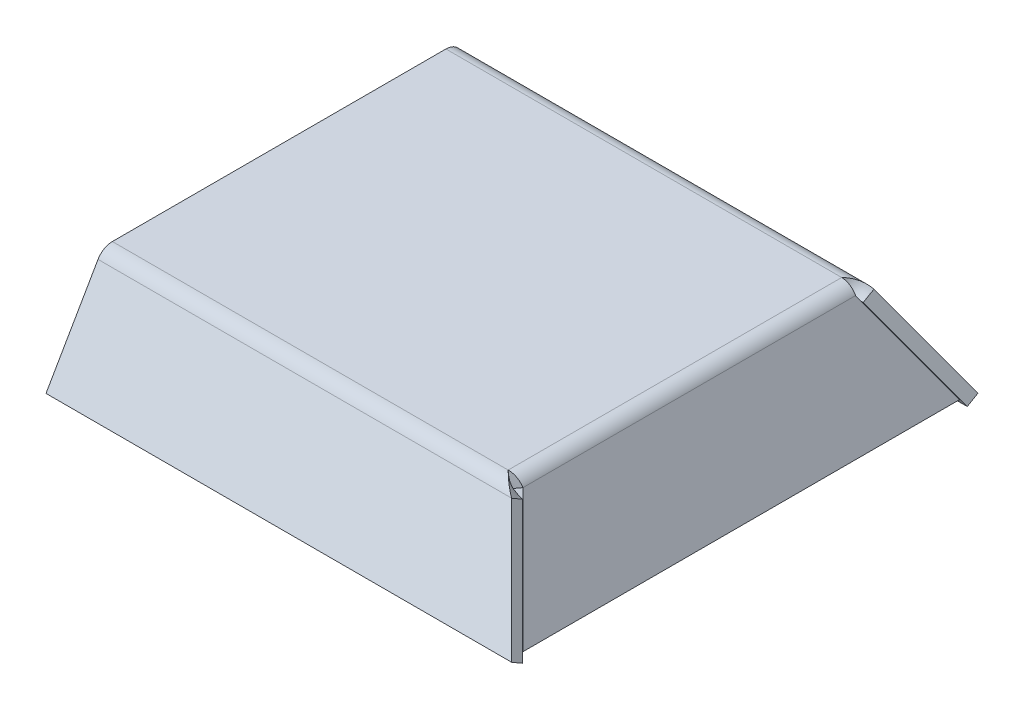
ISO-10303-21;
HEADER;
FILE_DESCRIPTION(('STEP AP214'),'2;1');
FILE_NAME('part.step','',(''),(''),'','','');
FILE_SCHEMA(('AUTOMOTIVE_DESIGN { 1 0 10303 214 1 1 1 1 }'));
ENDSEC;
DATA;
#1=APPLICATION_CONTEXT('core data for automotive mechanical design processes');
#2=APPLICATION_PROTOCOL_DEFINITION('international standard','automotive_design',2000,#1);
#3=PRODUCT_CONTEXT('',#1,'mechanical');
#4=PRODUCT('Part','Part','',(#3));
#5=PRODUCT_RELATED_PRODUCT_CATEGORY('part','',(#4));
#6=PRODUCT_DEFINITION_FORMATION('','',#4);
#7=PRODUCT_DEFINITION_CONTEXT('part definition',#1,'design');
#8=PRODUCT_DEFINITION('design','',#6,#7);
#9=PRODUCT_DEFINITION_SHAPE('','',#8);
#10=(LENGTH_UNIT() NAMED_UNIT(*) SI_UNIT(.MILLI.,.METRE.));
#11=(NAMED_UNIT(*) PLANE_ANGLE_UNIT() SI_UNIT($,.RADIAN.));
#12=(NAMED_UNIT(*) SI_UNIT($,.STERADIAN.) SOLID_ANGLE_UNIT());
#13=UNCERTAINTY_MEASURE_WITH_UNIT(LENGTH_MEASURE(1.E-05),#10,'distance_accuracy_value','');
#14=(GEOMETRIC_REPRESENTATION_CONTEXT(3) GLOBAL_UNCERTAINTY_ASSIGNED_CONTEXT((#13)) GLOBAL_UNIT_ASSIGNED_CONTEXT((#10,
#11,#12)) REPRESENTATION_CONTEXT('',''));
#15=CARTESIAN_POINT('',(0.,0.,0.));
#16=DIRECTION('',(0.,0.,1.));
#17=DIRECTION('',(1.,0.,0.));
#18=AXIS2_PLACEMENT_3D('',#15,#16,#17);
#19=CARTESIAN_POINT('',(0.,-3.00000000000002,0.));
#20=DIRECTION('',(0.,-1.,0.));
#21=DIRECTION('',(0.,0.,-1.));
#22=AXIS2_PLACEMENT_3D('',#19,#20,#21);
#23=PLANE('',#22);
#24=DIRECTION('',(0.,0.,1.));
#25=VECTOR('',#24,1.);
#26=CARTESIAN_POINT('',(0.,-3.00000000000002,0.));
#27=LINE('',#26,#25);
#28=CARTESIAN_POINT('',(0.,-3.00000000000002,-81.1259851993435));
#29=VERTEX_POINT('',#28);
#30=CARTESIAN_POINT('',(0.,-3.00000000000002,-0.577350269189626));
#31=VERTEX_POINT('',#30);
#32=EDGE_CURVE('E488',#29,#31,#27,.T.);
#33=ORIENTED_EDGE('',*,*,#32,.F.);
#34=DIRECTION('',(-1.,0.,0.));
#35=VECTOR('',#34,1.);
#36=CARTESIAN_POINT('',(95.743257010029,-3.00000000000003,-81.1259851993435));
#37=LINE('',#36,#35);
#38=CARTESIAN_POINT('',(95.584338387431,-3.00000000000003,-81.1259851993448));
#39=VERTEX_POINT('',#38);
#40=EDGE_CURVE('E497',#39,#29,#37,.T.);
#41=ORIENTED_EDGE('',*,*,#40,.F.);
#42=DIRECTION('',(0.,0.,-1.));
#43=VECTOR('',#42,1.);
#44=CARTESIAN_POINT('',(95.5843383874312,-3.00000000000002,-0.418431646591708));
#45=LINE('',#44,#43);
#46=CARTESIAN_POINT('',(95.5843383874312,-3.00000000000002,-0.577350269189633));
#47=VERTEX_POINT('',#46);
#48=EDGE_CURVE('E685',#47,#39,#45,.T.);
#49=ORIENTED_EDGE('',*,*,#48,.F.);
#50=DIRECTION('',(1.,0.,0.));
#51=VECTOR('',#50,1.);
#52=CARTESIAN_POINT('',(0.,-3.00000000000002,-0.577350269189626));
#53=LINE('',#52,#51);
#54=EDGE_CURVE('E490',#31,#47,#53,.T.);
#55=ORIENTED_EDGE('',*,*,#54,.F.);
#56=EDGE_LOOP('',(#33,#41,#49,#55));
#57=FACE_BOUND('',#56,.T.);
#58=ADVANCED_FACE('F81',(#57),#23,.T.);
#59=CARTESIAN_POINT('',(0.,0.,0.));
#60=DIRECTION('',(0.,-1.,0.));
#61=DIRECTION('',(0.,0.,-1.));
#62=AXIS2_PLACEMENT_3D('',#59,#60,#61);
#63=PLANE('',#62);
#64=DIRECTION('',(-1.,0.,0.));
#65=VECTOR('',#64,1.);
#66=CARTESIAN_POINT('',(95.743257010029,0.,-81.1259851993435));
#67=LINE('',#66,#65);
#68=CARTESIAN_POINT('',(95.584338387431,0.,-81.1259851993435));
#69=VERTEX_POINT('',#68);
#70=CARTESIAN_POINT('',(0.,0.,-81.1259851993435));
#71=VERTEX_POINT('',#70);
#72=EDGE_CURVE('E619',#69,#71,#67,.T.);
#73=ORIENTED_EDGE('',*,*,#72,.T.);
#74=DIRECTION('',(0.,0.,1.));
#75=VECTOR('',#74,1.);
#76=CARTESIAN_POINT('',(0.,0.,0.));
#77=LINE('',#76,#75);
#78=CARTESIAN_POINT('',(0.,0.,-0.577350269189619));
#79=VERTEX_POINT('',#78);
#80=EDGE_CURVE('E491',#71,#79,#77,.T.);
#81=ORIENTED_EDGE('',*,*,#80,.T.);
#82=DIRECTION('',(1.,0.,0.));
#83=VECTOR('',#82,1.);
#84=CARTESIAN_POINT('',(0.,0.,-0.577350269189619));
#85=LINE('',#84,#83);
#86=CARTESIAN_POINT('',(95.5843383874311,0.,-0.577350269189647));
#87=VERTEX_POINT('',#86);
#88=EDGE_CURVE('E97',#79,#87,#85,.T.);
#89=ORIENTED_EDGE('',*,*,#88,.T.);
#90=DIRECTION('',(0.,0.,-1.));
#91=VECTOR('',#90,1.);
#92=CARTESIAN_POINT('',(95.5843383874312,0.,-0.418431646591715));
#93=LINE('',#92,#91);
#94=EDGE_CURVE('E90',#87,#69,#93,.T.);
#95=ORIENTED_EDGE('',*,*,#94,.T.);
#96=EDGE_LOOP('',(#73,#81,#89,#95));
#97=FACE_BOUND('',#96,.T.);
#98=ADVANCED_FACE('F438',(#97),#63,.F.);
#99=CARTESIAN_POINT('',(0.,-3.00000000000002,0.));
#100=DIRECTION('',(-1.,0.,0.));
#101=DIRECTION('',(0.,0.,1.));
#102=AXIS2_PLACEMENT_3D('',#99,#100,#101);
#103=PLANE('',#102);
#104=DIRECTION('',(0.,1.,0.));
#105=VECTOR('',#104,1.);
#106=CARTESIAN_POINT('',(0.,-3.00000000000003,-81.1259851993435));
#107=LINE('',#106,#105);
#108=EDGE_CURVE('E613',#29,#71,#107,.T.);
#109=ORIENTED_EDGE('',*,*,#108,.F.);
#110=ORIENTED_EDGE('',*,*,#32,.T.);
#111=DIRECTION('',(0.,1.,0.));
#112=VECTOR('',#111,1.);
#113=CARTESIAN_POINT('',(0.,-3.00000000000002,-0.577350269189626));
#114=LINE('',#113,#112);
#115=EDGE_CURVE('E494',#31,#79,#114,.T.);
#116=ORIENTED_EDGE('',*,*,#115,.T.);
#117=ORIENTED_EDGE('',*,*,#80,.F.);
#118=EDGE_LOOP('',(#109,#110,#116,#117));
#119=FACE_BOUND('',#118,.T.);
#120=ADVANCED_FACE('F83',(#119),#103,.T.);
#121=CARTESIAN_POINT('',(96.1616886566208,-23.75685287726,15.4480762113534));
#122=DIRECTION('',(0.,0.866025403784437,-0.500000000000004));
#123=DIRECTION('',(0.,0.500000000000004,0.866025403784437));
#124=AXIS2_PLACEMENT_3D('',#121,#122,#123);
#125=PLANE('',#124);
#126=DIRECTION('',(1.,0.,0.));
#127=VECTOR('',#126,1.);
#128=CARTESIAN_POINT('',(96.1616886566208,-25.25685287726,12.8500000000001));
#129=LINE('',#128,#127);
#130=CARTESIAN_POINT('',(0.,-25.25685287726,12.8500000000001));
#131=VERTEX_POINT('',#130);
#132=CARTESIAN_POINT('',(112.475790271759,-25.25685287726,12.8500000000001));
#133=VERTEX_POINT('',#132);
#134=EDGE_CURVE('E563',#131,#133,#129,.T.);
#135=ORIENTED_EDGE('',*,*,#134,.T.);
#136=DIRECTION('',(0.,-0.500000000000004,-0.866025403784436));
#137=VECTOR('',#136,1.);
#138=CARTESIAN_POINT('',(112.475790271759,-23.75685287726,15.4480762113534));
#139=LINE('',#138,#137);
#140=CARTESIAN_POINT('',(112.475790271759,-23.75685287726,15.4480762113534));
#141=VERTEX_POINT('',#140);
#142=EDGE_CURVE('E484',#141,#133,#139,.T.);
#143=ORIENTED_EDGE('',*,*,#142,.F.);
#144=DIRECTION('',(1.,0.,0.));
#145=VECTOR('',#144,1.);
#146=CARTESIAN_POINT('',(96.1616886566208,-23.75685287726,15.4480762113534));
#147=LINE('',#146,#145);
#148=CARTESIAN_POINT('',(0.,-23.75685287726,15.4480762113534));
#149=VERTEX_POINT('',#148);
#150=EDGE_CURVE('E556',#149,#141,#147,.T.);
#151=ORIENTED_EDGE('',*,*,#150,.F.);
#152=DIRECTION('',(0.,-0.500000000000004,-0.866025403784437));
#153=VECTOR('',#152,1.);
#154=CARTESIAN_POINT('',(0.,-23.75685287726,15.4480762113534));
#155=LINE('',#154,#153);
#156=EDGE_CURVE('E560',#149,#131,#155,.T.);
#157=ORIENTED_EDGE('',*,*,#156,.T.);
#158=EDGE_LOOP('',(#135,#143,#151,#157));
#159=FACE_BOUND('',#158,.T.);
#160=ADVANCED_FACE('F530',(#159),#125,.F.);
#161=CARTESIAN_POINT('',(0.,-0.750000000000028,-1.29903810567666));
#162=DIRECTION('',(0.,-0.500000000000004,-0.866025403784437));
#163=DIRECTION('',(0.,0.866025403784437,-0.500000000000004));
#164=AXIS2_PLACEMENT_3D('',#161,#162,#163);
#165=PLANE('',#164);
#166=DIRECTION('',(-1.,0.,0.));
#167=VECTOR('',#166,1.);
#168=CARTESIAN_POINT('',(96.1616886566208,-3.5,0.288675134594817));
#169=LINE('',#168,#167);
#170=CARTESIAN_POINT('',(99.9144654063534,-3.5,0.288675134594817));
#171=VERTEX_POINT('',#170);
#172=CARTESIAN_POINT('',(0.,-3.5,0.288675134594817));
#173=VERTEX_POINT('',#172);
#174=EDGE_CURVE('E567',#171,#173,#169,.T.);
#175=ORIENTED_EDGE('',*,*,#174,.F.);
#176=DIRECTION('',(0.447213595499961,-0.77459666924148,0.44721359549996));
#177=VECTOR('',#176,1.);
#178=CARTESIAN_POINT('',(99.9144654063534,-3.5,0.288675134594817));
#179=LINE('',#178,#177);
#180=EDGE_CURVE('E485',#171,#133,#179,.T.);
#181=ORIENTED_EDGE('',*,*,#180,.T.);
#182=ORIENTED_EDGE('',*,*,#134,.F.);
#183=DIRECTION('',(0.,-0.866025403784437,0.500000000000004));
#184=VECTOR('',#183,1.);
#185=CARTESIAN_POINT('',(0.,-25.25685287726,12.8500000000001));
#186=LINE('',#185,#184);
#187=EDGE_CURVE('E493',#173,#131,#186,.T.);
#188=ORIENTED_EDGE('',*,*,#187,.F.);
#189=EDGE_LOOP('',(#175,#181,#182,#188));
#190=FACE_BOUND('',#189,.T.);
#191=ADVANCED_FACE('F459',(#190),#165,.T.);
#192=CARTESIAN_POINT('',(99.9144654063534,-1.99999999999999,2.88675134594812));
#193=DIRECTION('',(0.894427190999915,0.387298334620743,-0.223606797749982));
#194=DIRECTION('',(-0.397359707119515,0.917662935482246,0.));
#195=AXIS2_PLACEMENT_3D('',#192,#193,#194);
#196=PLANE('',#195);
#197=ORIENTED_EDGE('',*,*,#180,.F.);
#198=CARTESIAN_POINT('',(99.9144654063534,-1.985,2.91273210806166));
#199=CARTESIAN_POINT('',(99.9144654063534,-1.99999999999999,2.88675134594812));
#200=CARTESIAN_POINT('',(99.9144654063534,-3.5,0.288675134594817));
#201=CARTESIAN_POINT('',(99.9144654063534,-3.51515000000001,0.262434564860151));
#202=B_SPLINE_CURVE_WITH_KNOTS('',1,(#198,#199,#200,#201),.UNSPECIFIED.,.F.,.F.,(2,1,1,2),
(-0.01,0.,1.,1.0101),.UNSPECIFIED.);
#203=CARTESIAN_POINT('',(99.9144654063534,-1.99999999999999,2.88675134594812));
#204=VERTEX_POINT('',#203);
#205=EDGE_CURVE('E477',#204,#171,#202,.T.);
#206=ORIENTED_EDGE('',*,*,#205,.F.);
#207=DIRECTION('',(0.447213595499961,-0.77459666924148,0.44721359549996));
#208=VECTOR('',#207,1.);
#209=CARTESIAN_POINT('',(99.9144654063534,-1.99999999999999,2.88675134594812));
#210=LINE('',#209,#208);
#211=EDGE_CURVE('E481',#204,#141,#210,.T.);
#212=ORIENTED_EDGE('',*,*,#211,.T.);
#213=ORIENTED_EDGE('',*,*,#142,.T.);
#214=EDGE_LOOP('',(#197,#206,#212,#213));
#215=FACE_BOUND('',#214,.T.);
#216=ADVANCED_FACE('F454',(#215),#196,.T.);
#217=CARTESIAN_POINT('',(0.,0.749999999999987,1.29903810567665));
#218=DIRECTION('',(0.,-0.500000000000004,-0.866025403784437));
#219=DIRECTION('',(0.,0.866025403784437,-0.500000000000004));
#220=AXIS2_PLACEMENT_3D('',#217,#218,#219);
#221=PLANE('',#220);
#222=ORIENTED_EDGE('',*,*,#150,.T.);
#223=ORIENTED_EDGE('',*,*,#211,.F.);
#224=DIRECTION('',(1.,0.,0.));
#225=VECTOR('',#224,1.);
#226=CARTESIAN_POINT('',(0.,-1.99999999999999,2.88675134594812));
#227=LINE('',#226,#225);
#228=CARTESIAN_POINT('',(0.,-1.99999999999999,2.88675134594812));
#229=VERTEX_POINT('',#228);
#230=EDGE_CURVE('E469',#229,#204,#227,.T.);
#231=ORIENTED_EDGE('',*,*,#230,.F.);
#232=DIRECTION('',(0.,-0.866025403784437,0.500000000000004));
#233=VECTOR('',#232,1.);
#234=CARTESIAN_POINT('',(0.,-23.75685287726,15.4480762113534));
#235=LINE('',#234,#233);
#236=EDGE_CURVE('E554',#229,#149,#235,.T.);
#237=ORIENTED_EDGE('',*,*,#236,.T.);
#238=EDGE_LOOP('',(#222,#223,#231,#237));
#239=FACE_BOUND('',#238,.T.);
#240=ADVANCED_FACE('F450',(#239),#221,.F.);
#241=CARTESIAN_POINT('',(0.,-23.75685287726,15.4480762113534));
#242=DIRECTION('',(1.,0.,0.));
#243=DIRECTION('',(0.,0.,-1.));
#244=AXIS2_PLACEMENT_3D('',#241,#242,#243);
#245=PLANE('',#244);
#246=DIRECTION('',(0.,0.500000000000004,0.866025403784437));
#247=VECTOR('',#246,1.);
#248=CARTESIAN_POINT('',(0.,-3.5,0.288675134594817));
#249=LINE('',#248,#247);
#250=EDGE_CURVE('E478',#173,#229,#249,.T.);
#251=ORIENTED_EDGE('',*,*,#250,.F.);
#252=ORIENTED_EDGE('',*,*,#187,.T.);
#253=ORIENTED_EDGE('',*,*,#156,.F.);
#254=ORIENTED_EDGE('',*,*,#236,.F.);
#255=EDGE_LOOP('',(#251,#252,#253,#254));
#256=FACE_BOUND('',#255,.T.);
#257=ADVANCED_FACE('F446',(#256),#245,.F.);
#258=CARTESIAN_POINT('',(0.,-4.,-0.577350269189619));
#259=DIRECTION('',(1.,0.,0.));
#260=DIRECTION('',(0.,0.,-1.));
#261=AXIS2_PLACEMENT_3D('',#258,#259,#260);
#262=PLANE('',#261);
#263=ORIENTED_EDGE('',*,*,#250,.T.);
#264=CARTESIAN_POINT('',(0.,-4.,-0.577350269189619));
#265=DIRECTION('',(1.,0.,0.));
#266=DIRECTION('',(0.,0.,-1.));
#267=AXIS2_PLACEMENT_3D('',#264,#265,#266);
#268=CIRCLE('',#267,4.);
#269=EDGE_CURVE('E509',#229,#79,#268,.F.);
#270=ORIENTED_EDGE('',*,*,#269,.T.);
#271=ORIENTED_EDGE('',*,*,#115,.F.);
#272=CARTESIAN_POINT('',(0.,-4.,-0.577350269189619));
#273=DIRECTION('',(-1.,0.,0.));
#274=DIRECTION('',(0.,0.,1.));
#275=AXIS2_PLACEMENT_3D('',#272,#273,#274);
#276=CIRCLE('',#275,1.);
#277=EDGE_CURVE('E508',#173,#31,#276,.T.);
#278=ORIENTED_EDGE('',*,*,#277,.F.);
#279=EDGE_LOOP('',(#263,#270,#271,#278));
#280=FACE_BOUND('',#279,.T.);
#281=ADVANCED_FACE('F449',(#280),#262,.F.);
#282=CARTESIAN_POINT('',(95.5843383874312,0.0299999999999884,-0.57735026918964));
#283=CARTESIAN_POINT('',(96.306225401968,0.0299999999999884,0.126210259898896));
#284=CARTESIAN_POINT('',(97.0277140604053,-0.15823377847185,0.828515444321706));
#285=CARTESIAN_POINT('',(98.4710897333793,-0.861601467025561,2.04678401729903));
#286=CARTESIAN_POINT('',(99.1925783918166,-1.37569870870931,2.56095184351739));
#287=CARTESIAN_POINT('',(99.9144654063534,-1.985,2.91273210806166));
#288=CARTESIAN_POINT('',(95.5843383874312,0.,-0.57735026918964));
#289=CARTESIAN_POINT('',(96.3062236533384,0.,0.120972416865081));
#290=CARTESIAN_POINT('',(97.0277140604053,-0.186832534463374,0.818049942732289));
#291=CARTESIAN_POINT('',(98.4710897333793,-0.884964235261104,2.02724951888844));
#292=CARTESIAN_POINT('',(99.1925801404462,-1.39523481383762,2.53759000292075));
#293=CARTESIAN_POINT('',(99.9144654063534,-1.99999999999999,2.88675134594812));
#294=CARTESIAN_POINT('',(95.5843383874312,-3.00000000000002,-0.577350269189633));
#295=CARTESIAN_POINT('',(96.3060487903868,-3.00000000000002,-0.402811886517342));
#296=CARTESIAN_POINT('',(97.0277140604053,-3.04670813361586,-0.22850021620914));
#297=CARTESIAN_POINT('',(98.4710897333793,-3.22124105881529,0.0737996778298958));
#298=CARTESIAN_POINT('',(99.1927550033978,-3.34884532667036,0.201405943258681));
#299=CARTESIAN_POINT('',(99.9144654063534,-3.5,0.288675134594817));
#300=CARTESIAN_POINT('',(95.5843383874312,-3.03030000000001,-0.577350269189619));
#301=CARTESIAN_POINT('',(96.306047024271,-3.0303,-0.408102107981492));
#302=CARTESIAN_POINT('',(97.0277140604053,-3.07559287716729,-0.239070372814454));
#303=CARTESIAN_POINT('',(98.4710897333793,-3.24483745473318,0.0540698344352053));
#304=CARTESIAN_POINT('',(99.1927567695136,-3.36857679284996,0.177810484256094));
#305=CARTESIAN_POINT('',(99.9144654063534,-3.51515000000001,0.262434564860151));
#306=B_SPLINE_SURFACE_WITH_KNOTS('',1,3,((#282,#283,#284,#285,#286,#287),(#288,#289,#290,#291,
#292,#293),(#294,#295,#296,#297,#298,#299),(#300,#301,#302,#303,#304,#305)),.UNSPECIFIED.,.F.,
.F.,.F.,(2,1,1,2),(4,2,4),(-0.01,0.,1.,1.0101),(0.,0.5,1.),.UNSPECIFIED.);
#307=CARTESIAN_POINT('',(95.5843383874312,0.,-0.57735026918964));
#308=CARTESIAN_POINT('',(95.6958763429388,9.64170182455182E-06,-0.469459538888443));
#309=CARTESIAN_POINT('',(95.8074171074141,-0.00436479653860869,-0.361573140850284));
#310=CARTESIAN_POINT('',(96.0304895739114,-0.0218102100082463,-0.146509283072139));
#311=CARTESIAN_POINT('',(96.1420212760819,-0.0348806765867254,-0.0393317822374149));
#312=CARTESIAN_POINT('',(96.3650724777999,-0.0696463042124802,0.1736253496666));
#313=CARTESIAN_POINT('',(96.4765919774922,-0.0913413485796098,0.279404999627126));
#314=CARTESIAN_POINT('',(96.6997137688825,-0.143230824128573,0.488946896171849));
#315=CARTESIAN_POINT('',(96.8113160584334,-0.173431765686241,0.592707532120703));
#316=CARTESIAN_POINT('',(97.0345248706423,-0.242125636553652,0.797435830910469));
#317=CARTESIAN_POINT('',(97.1461313929287,-0.280618219487133,0.898403610221838));
#318=CARTESIAN_POINT('',(97.3693411648543,-0.365632702029188,1.09687592918262));
#319=CARTESIAN_POINT('',(97.4809444143548,-0.412154177205594,1.19438065157159));
#320=CARTESIAN_POINT('',(97.7605578861454,-0.538406885960574,1.43355968099655));
#321=CARTESIAN_POINT('',(97.9285826987135,-0.623042629530928,1.57266450553993));
#322=CARTESIAN_POINT('',(98.2646353043147,-0.808608547932978,1.8395588385319));
#323=CARTESIAN_POINT('',(98.4326630952459,-0.909540694163135,1.96734697508526));
#324=CARTESIAN_POINT('',(98.7682482417835,-1.12591898749497,2.20939309705893));
#325=CARTESIAN_POINT('',(98.9358056636142,-1.24132594744445,2.32368605386928));
#326=CARTESIAN_POINT('',(99.2708665932738,-1.4850834390559,2.53736290911858));
#327=CARTESIAN_POINT('',(99.438370069447,-1.61342584434855,2.63675607154655));
#328=CARTESIAN_POINT('',(99.6572850397498,-1.78839586414964,2.75600995707381));
#329=CARTESIAN_POINT('',(99.7087427955607,-1.83004691586046,2.78327220252358));
#330=CARTESIAN_POINT('',(99.8116210293496,-1.91430916138356,2.83620579287156));
#331=CARTESIAN_POINT('',(99.8630415083023,-1.95691966546769,2.8618782338021));
#332=CARTESIAN_POINT('',(99.9144654063534,-1.99999999999999,2.88675134594812));
#333=B_SPLINE_CURVE_WITH_KNOTS('',3,(#307,#308,#309,#310,#311,#312,#313,#314,#315,#316,#317,
#318,#319,#320,#321,#322,#323,#324,#325,#326,#327,#328,#329,#330,#331,#332),.UNSPECIFIED.,.F.,
.F.,(4,2,2,2,2,2,2,2,2,2,2,2,4),(0.,0.465479773118104,0.930932321645649,1.39637857337531,
1.86218204828902,2.32796606843123,2.79372547332204,3.49477037434847,4.19590014537808,
4.89517116525189,5.59400559188796,5.8087760313208,6.02339671782439),.UNSPECIFIED.);
#334=EDGE_CURVE('E505',#87,#204,#333,.T.);
#335=CARTESIAN_POINT('',(95.5843383874312,-3.00000000000002,-0.577350269189633));
#336=CARTESIAN_POINT('',(95.7466962255924,-2.99998870759985,-0.538091194132343));
#337=CARTESIAN_POINT('',(95.9090532284926,-3.00231146984735,-0.49883129311785));
#338=CARTESIAN_POINT('',(96.2337703956508,-3.01154530958592,-0.420847740342531));
#339=CARTESIAN_POINT('',(96.3961305598714,-3.0184565145128,-0.38212410350598));
#340=CARTESIAN_POINT('',(96.7207834566695,-3.03678368857721,-0.30576883901965));
#341=CARTESIAN_POINT('',(96.8830761896665,-3.04819781408109,-0.268136771209028));
#342=CARTESIAN_POINT('',(97.2076567453754,-3.0753618175961,-0.194486066177878));
#343=CARTESIAN_POINT('',(97.3699445680175,-3.09111151863855,-0.158467363173095));
#344=CARTESIAN_POINT('',(97.73031186102,-3.13066178800326,-0.0808183876394749));
#345=CARTESIAN_POINT('',(97.9283923228201,-3.15547183645281,-0.0397021724597168));
#346=CARTESIAN_POINT('',(98.3245390290848,-3.21072642812878,0.0385578265620183));
#347=CARTESIAN_POINT('',(98.5226052737319,-3.24117066121031,0.0757018288848595));
#348=CARTESIAN_POINT('',(98.9196240519472,-3.30722106986446,0.145400468308589));
#349=CARTESIAN_POINT('',(99.1185765818951,-3.34284975399876,0.177933805510867));
#350=CARTESIAN_POINT('',(99.5165070468758,-3.41839918573694,0.237555394393284));
#351=CARTESIAN_POINT('',(99.7154849821527,-3.45832043601981,0.264643007286166));
#352=CARTESIAN_POINT('',(99.9144654063534,-3.5,0.288675134594817));
#353=B_SPLINE_CURVE_WITH_KNOTS('',3,(#335,#336,#337,#338,#339,#340,#341,#342,#343,#344,#345,
#346,#347,#348,#349,#350,#351,#352),.UNSPECIFIED.,.F.,.F.,(4,2,2,2,2,2,2,2,4),(0.,
0.501093779640076,1.00220147684758,1.50310421778645,2.00398651600504,2.61532165358948,
3.2266231490192,3.84066253587215,4.45477390800156),.UNSPECIFIED.);
#354=EDGE_CURVE('E517',#47,#171,#353,.T.);
#355=CARTESIAN_POINT('',(95.5843383874312,0.,-0.577350269189633));
#356=CARTESIAN_POINT('',(95.5843383874312,-3.00000000000002,-0.577350269189633));
#357=B_SPLINE_CURVE_WITH_KNOTS('',1,(#355,#356),.UNSPECIFIED.,.F.,.F.,(2,2),(0.,1.),.UNSPECIFIED.);
#358=EDGE_CURVE('E12',#87,#47,#357,.T.);
#359=ORIENTED_EDGE('',*,*,#334,.T.);
#360=ORIENTED_EDGE('',*,*,#205,.T.);
#361=ORIENTED_EDGE('',*,*,#354,.F.);
#362=ORIENTED_EDGE('',*,*,#358,.F.);
#363=EDGE_LOOP('',(#359,#360,#361,#362));
#364=FACE_BOUND('',#363,.T.);
#365=ADVANCED_FACE('F523',(#364),#306,.F.);
#366=CARTESIAN_POINT('',(-50.104537142326,-4.,-0.577350269189619));
#367=DIRECTION('',(1.,0.,0.));
#368=DIRECTION('',(0.,0.,-1.));
#369=AXIS2_PLACEMENT_3D('',#366,#367,#368);
#370=CYLINDRICAL_SURFACE('',#369,1.);
#371=ORIENTED_EDGE('',*,*,#54,.T.);
#372=ORIENTED_EDGE('',*,*,#354,.T.);
#373=ORIENTED_EDGE('',*,*,#174,.T.);
#374=ORIENTED_EDGE('',*,*,#277,.T.);
#375=EDGE_LOOP('',(#371,#372,#373,#374));
#376=FACE_BOUND('',#375,.T.);
#377=ADVANCED_FACE('F528',(#376),#370,.F.);
#378=CARTESIAN_POINT('',(-50.104537142326,-4.,-0.577350269189619));
#379=DIRECTION('',(1.,0.,0.));
#380=DIRECTION('',(0.,0.,-1.));
#381=AXIS2_PLACEMENT_3D('',#378,#379,#380);
#382=CYLINDRICAL_SURFACE('',#381,4.);
#383=ORIENTED_EDGE('',*,*,#88,.F.);
#384=ORIENTED_EDGE('',*,*,#269,.F.);
#385=ORIENTED_EDGE('',*,*,#230,.T.);
#386=ORIENTED_EDGE('',*,*,#334,.F.);
#387=EDGE_LOOP('',(#383,#384,#385,#386));
#388=FACE_BOUND('',#387,.T.);
#389=ADVANCED_FACE('F519',(#388),#382,.T.);
#390=CARTESIAN_POINT('',(0.,-23.75685287726,-97.1514116798865));
#391=DIRECTION('',(0.,0.866025403784437,0.500000000000004));
#392=DIRECTION('',(0.,-0.500000000000004,0.866025403784437));
#393=AXIS2_PLACEMENT_3D('',#390,#391,#392);
#394=PLANE('',#393);
#395=DIRECTION('',(-1.,0.,0.));
#396=VECTOR('',#395,1.);
#397=CARTESIAN_POINT('',(0.,-23.75685287726,-97.1514116798865));
#398=LINE('',#397,#396);
#399=CARTESIAN_POINT('',(112.475790271759,-23.75685287726,-97.1514116798865));
#400=VERTEX_POINT('',#399);
#401=CARTESIAN_POINT('',(0.,-23.75685287726,-97.1514116798865));
#402=VERTEX_POINT('',#401);
#403=EDGE_CURVE('E1006',#400,#402,#398,.T.);
#404=ORIENTED_EDGE('',*,*,#403,.F.);
#405=DIRECTION('',(0.,-0.500000000000004,0.866025403784437));
#406=VECTOR('',#405,1.);
#407=CARTESIAN_POINT('',(112.475790271759,-23.75685287726,-97.1514116798865));
#408=LINE('',#407,#406);
#409=CARTESIAN_POINT('',(112.475790271759,-25.25685287726,-94.5533354685332));
#410=VERTEX_POINT('',#409);
#411=EDGE_CURVE('E639',#400,#410,#408,.T.);
#412=ORIENTED_EDGE('',*,*,#411,.T.);
#413=DIRECTION('',(-1.,0.,0.));
#414=VECTOR('',#413,1.);
#415=CARTESIAN_POINT('',(0.,-25.25685287726,-94.5533354685332));
#416=LINE('',#415,#414);
#417=CARTESIAN_POINT('',(0.,-25.25685287726,-94.5533354685332));
#418=VERTEX_POINT('',#417);
#419=EDGE_CURVE('E634',#410,#418,#416,.T.);
#420=ORIENTED_EDGE('',*,*,#419,.T.);
#421=DIRECTION('',(0.,-0.500000000000004,0.866025403784437));
#422=VECTOR('',#421,1.);
#423=CARTESIAN_POINT('',(0.,-23.75685287726,-97.1514116798865));
#424=LINE('',#423,#422);
#425=EDGE_CURVE('E633',#402,#418,#424,.T.);
#426=ORIENTED_EDGE('',*,*,#425,.F.);
#427=EDGE_LOOP('',(#404,#412,#420,#426));
#428=FACE_BOUND('',#427,.T.);
#429=ADVANCED_FACE('F804',(#428),#394,.F.);
#430=CARTESIAN_POINT('',(0.,34.6285820448361,-59.9784634957229));
#431=DIRECTION('',(0.,-0.500000000000004,0.866025403784436));
#432=DIRECTION('',(0.,-0.866025403784436,-0.500000000000004));
#433=AXIS2_PLACEMENT_3D('',#430,#431,#432);
#434=PLANE('',#433);
#435=ORIENTED_EDGE('',*,*,#419,.F.);
#436=DIRECTION('',(0.447213595499961,-0.77459666924148,-0.447213595499961));
#437=VECTOR('',#436,1.);
#438=CARTESIAN_POINT('',(99.9144654063534,-3.50000000000002,-81.9920106031279));
#439=LINE('',#438,#437);
#440=CARTESIAN_POINT('',(99.9144654063534,-3.50000000000002,-81.9920106031279));
#441=VERTEX_POINT('',#440);
#442=EDGE_CURVE('E649',#441,#410,#439,.T.);
#443=ORIENTED_EDGE('',*,*,#442,.F.);
#444=DIRECTION('',(1.,0.,0.));
#445=VECTOR('',#444,1.);
#446=CARTESIAN_POINT('',(0.,-3.50000000000002,-81.9920106031279));
#447=LINE('',#446,#445);
#448=CARTESIAN_POINT('',(0.,-3.50000000000002,-81.9920106031279));
#449=VERTEX_POINT('',#448);
#450=EDGE_CURVE('E365',#449,#441,#447,.T.);
#451=ORIENTED_EDGE('',*,*,#450,.F.);
#452=DIRECTION('',(0.,0.866025403784436,0.500000000000004));
#453=VECTOR('',#452,1.);
#454=CARTESIAN_POINT('',(0.,-3.00000000000002,-81.7033354685331));
#455=LINE('',#454,#453);
#456=EDGE_CURVE('E637',#418,#449,#455,.T.);
#457=ORIENTED_EDGE('',*,*,#456,.F.);
#458=EDGE_LOOP('',(#435,#443,#451,#457));
#459=FACE_BOUND('',#458,.T.);
#460=ADVANCED_FACE('F798',(#459),#434,.T.);
#461=CARTESIAN_POINT('',(0.,-1.5,-84.3014116798864));
#462=DIRECTION('',(1.,0.,0.));
#463=DIRECTION('',(0.,0.,-1.));
#464=AXIS2_PLACEMENT_3D('',#461,#462,#463);
#465=PLANE('',#464);
#466=DIRECTION('',(0.,0.500000000000004,-0.866025403784436));
#467=VECTOR('',#466,1.);
#468=CARTESIAN_POINT('',(0.,-3.50000000000002,-81.9920106031279));
#469=LINE('',#468,#467);
#470=CARTESIAN_POINT('',(0.,-2.,-84.5900868144812));
#471=VERTEX_POINT('',#470);
#472=EDGE_CURVE('E628',#449,#471,#469,.T.);
#473=ORIENTED_EDGE('',*,*,#472,.T.);
#474=DIRECTION('',(0.,0.866025403784436,0.500000000000004));
#475=VECTOR('',#474,1.);
#476=CARTESIAN_POINT('',(0.,-1.5,-84.3014116798864));
#477=LINE('',#476,#475);
#478=EDGE_CURVE('E652',#402,#471,#477,.T.);
#479=ORIENTED_EDGE('',*,*,#478,.F.);
#480=ORIENTED_EDGE('',*,*,#425,.T.);
#481=ORIENTED_EDGE('',*,*,#456,.T.);
#482=EDGE_LOOP('',(#473,#479,#480,#481));
#483=FACE_BOUND('',#482,.T.);
#484=ADVANCED_FACE('F791',(#483),#465,.F.);
#485=CARTESIAN_POINT('',(0.,36.1285820448361,-62.5765397070762));
#486=DIRECTION('',(0.,-0.500000000000004,0.866025403784436));
#487=DIRECTION('',(0.,-0.866025403784436,-0.500000000000004));
#488=AXIS2_PLACEMENT_3D('',#485,#486,#487);
#489=PLANE('',#488);
#490=DIRECTION('',(-1.,0.,0.));
#491=VECTOR('',#490,1.);
#492=CARTESIAN_POINT('',(0.,-2.,-84.5900868144813));
#493=LINE('',#492,#491);
#494=CARTESIAN_POINT('',(99.9144654063534,-2.00000000000002,-84.5900868144812));
#495=VERTEX_POINT('',#494);
#496=EDGE_CURVE('E645',#495,#471,#493,.T.);
#497=ORIENTED_EDGE('',*,*,#496,.F.);
#498=DIRECTION('',(0.447213595499961,-0.77459666924148,-0.447213595499961));
#499=VECTOR('',#498,1.);
#500=CARTESIAN_POINT('',(99.9144654063534,-2.00000000000001,-84.5900868144812));
#501=LINE('',#500,#499);
#502=EDGE_CURVE('E663',#495,#400,#501,.T.);
#503=ORIENTED_EDGE('',*,*,#502,.T.);
#504=ORIENTED_EDGE('',*,*,#403,.T.);
#505=ORIENTED_EDGE('',*,*,#478,.T.);
#506=EDGE_LOOP('',(#497,#503,#504,#505));
#507=FACE_BOUND('',#506,.T.);
#508=ADVANCED_FACE('F673',(#507),#489,.F.);
#509=CARTESIAN_POINT('',(99.9144654063534,-2.00000000000001,-84.5900868144812));
#510=DIRECTION('',(-0.894427190999914,-0.387298334620743,-0.223606797749982));
#511=DIRECTION('',(0.397359707119515,-0.917662935482246,0.));
#512=AXIS2_PLACEMENT_3D('',#509,#510,#511);
#513=PLANE('',#512);
#514=ORIENTED_EDGE('',*,*,#442,.T.);
#515=ORIENTED_EDGE('',*,*,#411,.F.);
#516=ORIENTED_EDGE('',*,*,#502,.F.);
#517=CARTESIAN_POINT('',(99.9144654063534,-3.51500000000002,-81.9660298410144));
#518=CARTESIAN_POINT('',(99.9144654063534,-3.50000000000002,-81.9920106031279));
#519=CARTESIAN_POINT('',(99.9144654063534,-2.00000000000003,-84.5900868144813));
#520=CARTESIAN_POINT('',(99.9144654063534,-1.98485000000003,-84.6163273842159));
#521=B_SPLINE_CURVE_WITH_KNOTS('',1,(#517,#518,#519,#520),.UNSPECIFIED.,.F.,.F.,(2,1,1,2),
(-0.0101,-9.9999999999989E-05,0.9999,1.01),.UNSPECIFIED.);
#522=EDGE_CURVE('E588',#495,#441,#521,.F.);
#523=ORIENTED_EDGE('',*,*,#522,.T.);
#524=EDGE_LOOP('',(#514,#515,#516,#523));
#525=FACE_BOUND('',#524,.T.);
#526=ADVANCED_FACE('F388',(#525),#513,.F.);
#527=CARTESIAN_POINT('',(99.9144654063534,-1.98485000000003,-84.6163273842159));
#528=CARTESIAN_POINT('',(99.1925783743303,-1.37550334765836,-84.2645209304567));
#529=CARTESIAN_POINT('',(98.4710897333793,-0.861367839343769,-83.7503148308168));
#530=CARTESIAN_POINT('',(97.0277140604051,-0.157947790912524,-82.5319555678721));
#531=CARTESIAN_POINT('',(96.3062254194541,0.0302999999995984,-81.8295981068642));
#532=CARTESIAN_POINT('',(95.584338387431,0.0302999999999792,-81.1259851993457));
#533=CARTESIAN_POINT('',(99.9144654063534,-2.00000000000003,-84.5900868144813));
#534=CARTESIAN_POINT('',(99.1925801404461,-1.39523481383796,-84.2409254714541));
#535=CARTESIAN_POINT('',(98.4710897333793,-0.884964235261662,-83.7305849874221));
#536=CARTESIAN_POINT('',(97.0277140604051,-0.18683253446396,-82.5213854112668));
#537=CARTESIAN_POINT('',(96.3062236533383,-3.98781162356187E-13,-81.8243078854));
#538=CARTESIAN_POINT('',(95.584338387431,0.,-81.1259851993456));
#539=CARTESIAN_POINT('',(99.9144654063534,-3.50000000000002,-81.9920106031279));
#540=CARTESIAN_POINT('',(99.1927550033978,-3.34884532667046,-81.9047414117918));
#541=CARTESIAN_POINT('',(98.4710897333793,-3.22124105881543,-81.7771351463631));
#542=CARTESIAN_POINT('',(97.0277140604051,-3.04670813361601,-81.4748352523243));
#543=CARTESIAN_POINT('',(96.3060487903866,-3.00000000000012,-81.3005235820162));
#544=CARTESIAN_POINT('',(95.584338387431,-3.00000000000002,-81.125985199344));
#545=CARTESIAN_POINT('',(99.9144654063534,-3.51500000000002,-81.9660298410144));
#546=CARTESIAN_POINT('',(99.1927567520273,-3.36838143179878,-81.8813795711952));
#547=CARTESIAN_POINT('',(98.4710897333793,-3.24460382705097,-81.7576006479525));
#548=CARTESIAN_POINT('',(97.0277140604051,-3.07530688960753,-81.4643697507349));
#549=CARTESIAN_POINT('',(96.3060470417571,-3.03000000000011,-81.2952857389824));
#550=CARTESIAN_POINT('',(95.584338387431,-3.03000000000002,-81.125985199344));
#551=B_SPLINE_SURFACE_WITH_KNOTS('',1,3,((#527,#528,#529,#530,#531,#532),(#533,#534,#535,#536,
#537,#538),(#539,#540,#541,#542,#543,#544),(#545,#546,#547,#548,#549,#550)),.UNSPECIFIED.,.F.,
.F.,.F.,(2,1,1,2),(4,2,4),(-0.0101,0.,1.,1.01),(0.,0.5,1.),.UNSPECIFIED.);
#552=CARTESIAN_POINT('',(99.9144654063534,-2.00000000000003,-84.5900868144813));
#553=CARTESIAN_POINT('',(99.8029251619297,-1.90655714831681,-84.5361486931352));
#554=CARTESIAN_POINT('',(99.6913821086792,-1.81531017881789,-84.4784158567869));
#555=CARTESIAN_POINT('',(99.4683050640849,-1.63777868126219,-84.3557729443717));
#556=CARTESIAN_POINT('',(99.3567710725927,-1.55149386332305,-84.2908632882139));
#557=CARTESIAN_POINT('',(99.1337152919839,-1.3844474144328,-84.1542734459916));
#558=CARTESIAN_POINT('',(99.0221935027229,-1.3036857088099,-84.0825933514937));
#559=CARTESIAN_POINT('',(98.7990671373393,-1.14815939841648,-83.9328809546498));
#560=CARTESIAN_POINT('',(98.6874625633633,-1.07339944350034,-83.8548438197113));
#561=CARTESIAN_POINT('',(98.4642491824444,-0.930444621753181,-83.6929847726463));
#562=CARTESIAN_POINT('',(98.3526403758731,-0.862249480783852,-83.609163102326));
#563=CARTESIAN_POINT('',(98.1294260384064,-0.732873441432778,-83.4362976341231));
#564=CARTESIAN_POINT('',(98.0178205076498,-0.671692172426593,-83.3472541125479));
#565=CARTESIAN_POINT('',(97.7382047170095,-0.527684495612078,-83.1183232141481));
#566=CARTESIAN_POINT('',(97.5701798678434,-0.449535462388048,-82.975473288881));
#567=CARTESIAN_POINT('',(97.2341271922407,-0.311184053957823,-82.6813198778215));
#568=CARTESIAN_POINT('',(97.066099367906,-0.250983852445627,-82.5300153707691));
#569=CARTESIAN_POINT('',(96.7305141746189,-0.149557978556528,-82.2216021490794));
#570=CARTESIAN_POINT('',(96.5629567394437,-0.108282423866501,-82.0645098861195));
#571=CARTESIAN_POINT('',(96.2278957812547,-0.0451147645397425,-81.7465706238424));
#572=CARTESIAN_POINT('',(96.0603922899,-0.0232105735586937,-81.5857260301084));
#573=CARTESIAN_POINT('',(95.8414842223119,-0.00742130337271484,-81.3745771065113));
#574=CARTESIAN_POINT('',(95.7900333780597,-0.00463777956402357,-81.3248817718715));
#575=CARTESIAN_POINT('',(95.687168958463,-0.00092806451194623,-81.2254550648287));
#576=CARTESIAN_POINT('',(95.6357553821439,-5.79705670237803E-07,-81.1757237417067));
#577=CARTESIAN_POINT('',(95.584338387431,0.,-81.1259851993456));
#578=B_SPLINE_CURVE_WITH_KNOTS('',3,(#552,#553,#554,#555,#556,#557,#558,#559,#560,#561,#562,
#563,#564,#565,#566,#567,#568,#569,#570,#571,#572,#573,#574,#575,#576,#577),.UNSPECIFIED.,.F.,
.F.,(4,2,2,2,2,2,2,2,2,2,2,2,4),(0.,0.465489322070418,0.930951423184591,1.39640723006308,
1.86222023673048,2.32801378319193,2.79378270500604,3.494827758536,4.19595767770282,
4.89522875444957,5.59406322766202,5.80880482162939,6.02339669965032),.UNSPECIFIED.);
#579=EDGE_CURVE('E105',#495,#69,#578,.T.);
#580=CARTESIAN_POINT('',(95.584338387431,0.0302999999999792,-81.1259851993457));
#581=CARTESIAN_POINT('',(95.584338387431,0.,-81.1259851993456));
#582=CARTESIAN_POINT('',(95.584338387431,-3.00000000000002,-81.125985199344));
#583=CARTESIAN_POINT('',(95.584338387431,-3.03000000000002,-81.125985199344));
#584=B_SPLINE_CURVE_WITH_KNOTS('',1,(#580,#581,#582,#583),.UNSPECIFIED.,.F.,.F.,(2,1,1,2),
(-0.0101,0.,1.,1.01),.UNSPECIFIED.);
#585=EDGE_CURVE('E340',#69,#39,#584,.T.);
#586=CARTESIAN_POINT('',(99.9144654063534,-3.50000000000002,-81.9920106031279));
#587=CARTESIAN_POINT('',(99.7521075681922,-3.46599499747126,-81.9723908451047));
#588=CARTESIAN_POINT('',(99.589750565292,-3.43315630696642,-81.9507493234842));
#589=CARTESIAN_POINT('',(99.2650333981338,-3.37023748905495,-81.9037608073085));
#590=CARTESIAN_POINT('',(99.1026732339132,-3.34015743829104,-81.8784137098528));
#591=CARTESIAN_POINT('',(98.7780203371151,-3.28319542656543,-81.8243642792903));
#592=CARTESIAN_POINT('',(98.6157276041181,-3.25631216259643,-81.7956633227367));
#593=CARTESIAN_POINT('',(98.2911470484091,-3.20611078279034,-81.7353132531086));
#594=CARTESIAN_POINT('',(98.128859225767,-3.18279252149806,-81.7036642604015));
#595=CARTESIAN_POINT('',(97.7684919327646,-3.13532167079048,-81.6305882346384));
#596=CARTESIAN_POINT('',(97.5704114709644,-3.11211900816212,-81.5885439948221));
#597=CARTESIAN_POINT('',(97.1742647646997,-3.07197115674712,-81.5015621152442));
#598=CARTESIAN_POINT('',(96.9761985200526,-3.05502562367805,-81.4566246348354));
#599=CARTESIAN_POINT('',(96.5791797418372,-3.02769003565494,-81.3645739832988));
#600=CARTESIAN_POINT('',(96.3802272118893,-3.01732968123503,-81.3174519691339));
#601=CARTESIAN_POINT('',(95.9822967469086,-3.00347058651794,-81.222213447566));
#602=CARTESIAN_POINT('',(95.7833188116317,-2.99997265076624,-81.1740968242238));
#603=CARTESIAN_POINT('',(95.584338387431,-3.00000000000002,-81.125985199344));
#604=B_SPLINE_CURVE_WITH_KNOTS('',3,(#586,#587,#588,#589,#590,#591,#592,#593,#594,#595,#596,
#597,#598,#599,#600,#601,#602,#603),.UNSPECIFIED.,.F.,.F.,(4,2,2,2,2,2,2,2,4),(0.,
0.501093779640062,1.00220147684755,1.50310421778643,2.00398651600502,2.61532165358949,
3.22662314901927,3.84066253587221,4.45477390800163),.UNSPECIFIED.);
#605=EDGE_CURVE('E366',#441,#39,#604,.T.);
#606=ORIENTED_EDGE('',*,*,#522,.F.);
#607=ORIENTED_EDGE('',*,*,#579,.T.);
#608=ORIENTED_EDGE('',*,*,#585,.T.);
#609=ORIENTED_EDGE('',*,*,#605,.F.);
#610=EDGE_LOOP('',(#606,#607,#608,#609));
#611=FACE_BOUND('',#610,.T.);
#612=ADVANCED_FACE('F376',(#611),#551,.F.);
#613=CARTESIAN_POINT('',(0.,-4.00000000000002,-81.1259851993435));
#614=DIRECTION('',(1.,0.,0.));
#615=DIRECTION('',(0.,0.,-1.));
#616=AXIS2_PLACEMENT_3D('',#613,#614,#615);
#617=PLANE('',#616);
#618=CARTESIAN_POINT('',(0.,-4.00000000000002,-81.1259851993435));
#619=DIRECTION('',(-1.,0.,0.));
#620=DIRECTION('',(0.,0.,1.));
#621=AXIS2_PLACEMENT_3D('',#618,#619,#620);
#622=CIRCLE('',#621,4.);
#623=EDGE_CURVE('E367',#71,#471,#622,.T.);
#624=ORIENTED_EDGE('',*,*,#623,.T.);
#625=ORIENTED_EDGE('',*,*,#472,.F.);
#626=CARTESIAN_POINT('',(0.,-4.00000000000002,-81.1259851993435));
#627=DIRECTION('',(-1.,0.,0.));
#628=DIRECTION('',(0.,0.,1.));
#629=AXIS2_PLACEMENT_3D('',#626,#627,#628);
#630=CIRCLE('',#629,1.);
#631=EDGE_CURVE('E357',#29,#449,#630,.T.);
#632=ORIENTED_EDGE('',*,*,#631,.F.);
#633=ORIENTED_EDGE('',*,*,#108,.T.);
#634=EDGE_LOOP('',(#624,#625,#632,#633));
#635=FACE_BOUND('',#634,.T.);
#636=ADVANCED_FACE('F387',(#635),#617,.F.);
#637=CARTESIAN_POINT('',(150.019002548679,-4.00000000000002,-81.1259851993435));
#638=DIRECTION('',(-1.,0.,0.));
#639=DIRECTION('',(0.,0.,1.));
#640=AXIS2_PLACEMENT_3D('',#637,#638,#639);
#641=CYLINDRICAL_SURFACE('',#640,1.);
#642=ORIENTED_EDGE('',*,*,#40,.T.);
#643=ORIENTED_EDGE('',*,*,#631,.T.);
#644=ORIENTED_EDGE('',*,*,#450,.T.);
#645=ORIENTED_EDGE('',*,*,#605,.T.);
#646=EDGE_LOOP('',(#642,#643,#644,#645));
#647=FACE_BOUND('',#646,.T.);
#648=ADVANCED_FACE('F314',(#647),#641,.F.);
#649=CARTESIAN_POINT('',(150.019002548679,-4.00000000000002,-81.1259851993435));
#650=DIRECTION('',(-1.,0.,0.));
#651=DIRECTION('',(0.,0.,1.));
#652=AXIS2_PLACEMENT_3D('',#649,#650,#651);
#653=CYLINDRICAL_SURFACE('',#652,4.);
#654=ORIENTED_EDGE('',*,*,#72,.F.);
#655=ORIENTED_EDGE('',*,*,#579,.F.);
#656=ORIENTED_EDGE('',*,*,#496,.T.);
#657=ORIENTED_EDGE('',*,*,#623,.F.);
#658=EDGE_LOOP('',(#654,#655,#656,#657));
#659=FACE_BOUND('',#658,.T.);
#660=ADVANCED_FACE('F310',(#659),#653,.T.);
#661=CARTESIAN_POINT('',(95.5843383874309,0.,-81.1259851993448));
#662=CARTESIAN_POINT('',(96.2828648832483,0.,-81.1073407620206));
#663=CARTESIAN_POINT('',(96.9797385993529,-0.186832534463326,-81.0887173997194));
#664=CARTESIAN_POINT('',(98.1889381755092,-0.884964235261074,-81.051449600094));
#665=CARTESIAN_POINT('',(98.6991767546603,-1.39505830940572,-81.0328262377928));
#666=CARTESIAN_POINT('',(99.0484400025689,-2.00000000000005,-81.0141818004685));
#667=CARTESIAN_POINT('',(95.5843383874311,-3.00000000000002,-81.1259851993448));
#668=CARTESIAN_POINT('',(95.7589689685558,-3.,-81.1073408733577));
#669=CARTESIAN_POINT('',(95.9331884404116,-3.04670813361584,-81.0887173997194));
#670=CARTESIAN_POINT('',(96.2354883344507,-3.22124105881528,-81.051449600094));
#671=CARTESIAN_POINT('',(96.3630485006533,-3.3487654804684,-81.0328261264557));
#672=CARTESIAN_POINT('',(96.4503637912156,-3.50000000000003,-81.0141818004685));
#673=B_SPLINE_SURFACE_WITH_KNOTS('',1,3,((#661,#662,#663,#664,#665,#666),(#667,#668,#669,#670,
#671,#672)),.UNSPECIFIED.,.F.,.F.,.F.,(2,2),(4,2,4),(0.,1.),(0.,0.5,1.),.UNSPECIFIED.);
#674=CARTESIAN_POINT('',(95.5843383874309,0.,-81.1259851993448));
#675=CARTESIAN_POINT('',(96.2828648832483,0.,-81.1073407620206));
#676=CARTESIAN_POINT('',(96.9797385993529,-0.186832534463326,-81.0887173997194));
#677=CARTESIAN_POINT('',(98.1889381755092,-0.884964235261074,-81.051449600094));
#678=CARTESIAN_POINT('',(98.6991767546603,-1.39505830940572,-81.0328262377928));
#679=CARTESIAN_POINT('',(99.0484400025689,-2.00000000000005,-81.0141818004685));
#680=B_SPLINE_CURVE_WITH_KNOTS('',3,(#674,#675,#676,#677,#678,#679),.UNSPECIFIED.,.F.,.F.,(4,2,
4),(0.,0.5,1.),.UNSPECIFIED.);
#681=CARTESIAN_POINT('',(99.048440002569,-2.00000000000002,-81.0141818004685));
#682=VERTEX_POINT('',#681);
#683=EDGE_CURVE('E282',#69,#682,#680,.T.);
#684=CARTESIAN_POINT('',(99.0484400025689,-2.00000000000005,-81.0141818004685));
#685=CARTESIAN_POINT('',(96.4503637912156,-3.50000000000003,-81.0141818004685));
#686=B_SPLINE_CURVE_WITH_KNOTS('',1,(#684,#685),.UNSPECIFIED.,.F.,.F.,(2,2),(0.,1.),.UNSPECIFIED.);
#687=CARTESIAN_POINT('',(96.4503637912157,-3.50000000000003,-81.0141818004685));
#688=VERTEX_POINT('',#687);
#689=EDGE_CURVE('E213',#688,#682,#686,.F.);
#690=CARTESIAN_POINT('',(96.4503637912156,-3.50000000000003,-81.0141818004685));
#691=CARTESIAN_POINT('',(96.3630485006533,-3.3487654804684,-81.0328261264557));
#692=CARTESIAN_POINT('',(96.2354883344507,-3.22124105881528,-81.051449600094));
#693=CARTESIAN_POINT('',(95.9331884404116,-3.04670813361584,-81.0887173997194));
#694=CARTESIAN_POINT('',(95.7589689685558,-3.,-81.1073408733577));
#695=CARTESIAN_POINT('',(95.5843383874311,-3.00000000000002,-81.1259851993448));
#696=B_SPLINE_CURVE_WITH_KNOTS('',3,(#690,#691,#692,#693,#694,#695),.UNSPECIFIED.,.F.,.F.,(4,2,
4),(0.,0.5,1.),.UNSPECIFIED.);
#697=EDGE_CURVE('E276',#39,#688,#696,.F.);
#698=ORIENTED_EDGE('',*,*,#585,.F.);
#699=ORIENTED_EDGE('',*,*,#683,.T.);
#700=ORIENTED_EDGE('',*,*,#689,.F.);
#701=ORIENTED_EDGE('',*,*,#697,.F.);
#702=EDGE_LOOP('',(#698,#699,#700,#701));
#703=FACE_BOUND('',#702,.T.);
#704=ADVANCED_FACE('F299',(#703),#673,.F.);
#705=CARTESIAN_POINT('',(99.0484400025689,-2.00000000000003,-0.689153668064643));
#706=CARTESIAN_POINT('',(98.6991767546603,-1.3950583094057,-0.670509230740619));
#707=CARTESIAN_POINT('',(98.1889381755092,-0.88496423526113,-0.65188586843964));
#708=CARTESIAN_POINT('',(96.9797385993531,-0.186832534463396,-0.614618068814637));
#709=CARTESIAN_POINT('',(96.2828648832485,0.,-0.595994706513658));
#710=CARTESIAN_POINT('',(95.5843383874312,0.,-0.577350269189633));
#711=CARTESIAN_POINT('',(96.4503637912156,-3.50000000000002,-0.689153668064643));
#712=CARTESIAN_POINT('',(96.3630485006533,-3.3487654804684,-0.67050934207768));
#713=CARTESIAN_POINT('',(96.2354883344507,-3.2212410588153,-0.65188586843964));
#714=CARTESIAN_POINT('',(95.9331884404116,-3.04670813361586,-0.614618068814637));
#715=CARTESIAN_POINT('',(95.7589689685559,-3.00000000000002,-0.595994595176599));
#716=CARTESIAN_POINT('',(95.5843383874312,-3.00000000000002,-0.577350269189633));
#717=B_SPLINE_SURFACE_WITH_KNOTS('',1,3,((#705,#706,#707,#708,#709,#710),(#711,#712,#713,#714,
#715,#716)),.UNSPECIFIED.,.F.,.F.,.F.,(2,2),(4,2,4),(0.,1.),(0.,0.5,1.),.UNSPECIFIED.);
#718=CARTESIAN_POINT('',(96.4503637912156,-3.50000000000002,-0.689153668064643));
#719=CARTESIAN_POINT('',(99.0484400025689,-2.00000000000003,-0.689153668064643));
#720=B_SPLINE_CURVE_WITH_KNOTS('',1,(#718,#719),.UNSPECIFIED.,.F.,.F.,(2,2),(0.,1.),.UNSPECIFIED.);
#721=CARTESIAN_POINT('',(99.0484400025689,-2.00000000000003,-0.68915366806465));
#722=VERTEX_POINT('',#721);
#723=CARTESIAN_POINT('',(96.4503637912156,-3.50000000000002,-0.689153668064643));
#724=VERTEX_POINT('',#723);
#725=EDGE_CURVE('E712',#722,#724,#720,.F.);
#726=CARTESIAN_POINT('',(99.0484400025689,-2.00000000000003,-0.689153668064643));
#727=CARTESIAN_POINT('',(98.6991767546603,-1.3950583094057,-0.670509230740619));
#728=CARTESIAN_POINT('',(98.1889381755092,-0.88496423526113,-0.65188586843964));
#729=CARTESIAN_POINT('',(96.9797385993531,-0.186832534463396,-0.614618068814637));
#730=CARTESIAN_POINT('',(96.2828648832485,0.,-0.595994706513658));
#731=CARTESIAN_POINT('',(95.5843383874312,0.,-0.577350269189633));
#732=B_SPLINE_CURVE_WITH_KNOTS('',3,(#726,#727,#728,#729,#730,#731),.UNSPECIFIED.,.F.,.F.,(4,2,
4),(0.,0.5,1.),.UNSPECIFIED.);
#733=EDGE_CURVE('E693',#722,#87,#732,.T.);
#734=CARTESIAN_POINT('',(95.5843383874312,-3.00000000000002,-0.577350269189633));
#735=CARTESIAN_POINT('',(95.7589689685559,-3.00000000000002,-0.595994595176599));
#736=CARTESIAN_POINT('',(95.9331884404116,-3.04670813361586,-0.614618068814637));
#737=CARTESIAN_POINT('',(96.2354883344507,-3.2212410588153,-0.65188586843964));
#738=CARTESIAN_POINT('',(96.3630485006533,-3.3487654804684,-0.67050934207768));
#739=CARTESIAN_POINT('',(96.4503637912156,-3.50000000000002,-0.689153668064643));
#740=B_SPLINE_CURVE_WITH_KNOTS('',3,(#734,#735,#736,#737,#738,#739),.UNSPECIFIED.,.F.,.F.,(4,2,
4),(0.,0.5,1.),.UNSPECIFIED.);
#741=EDGE_CURVE('E411',#724,#47,#740,.F.);
#742=ORIENTED_EDGE('',*,*,#725,.F.);
#743=ORIENTED_EDGE('',*,*,#733,.T.);
#744=ORIENTED_EDGE('',*,*,#358,.T.);
#745=ORIENTED_EDGE('',*,*,#741,.F.);
#746=EDGE_LOOP('',(#742,#743,#744,#745));
#747=FACE_BOUND('',#746,.T.);
#748=ADVANCED_FACE('F251',(#747),#717,.F.);
#749=CARTESIAN_POINT('',(95.5843383874312,-4.00000000000002,-121.498654541318));
#750=DIRECTION('',(0.,0.,1.));
#751=DIRECTION('',(1.,0.,0.));
#752=AXIS2_PLACEMENT_3D('',#749,#750,#751);
#753=CYLINDRICAL_SURFACE('',#752,1.);
#754=ORIENTED_EDGE('',*,*,#741,.T.);
#755=ORIENTED_EDGE('',*,*,#48,.T.);
#756=ORIENTED_EDGE('',*,*,#697,.T.);
#757=DIRECTION('',(0.,0.,1.));
#758=VECTOR('',#757,1.);
#759=CARTESIAN_POINT('',(96.4503637912156,-3.50000000000002,-81.7033354685331));
#760=LINE('',#759,#758);
#761=EDGE_CURVE('E227',#688,#724,#760,.T.);
#762=ORIENTED_EDGE('',*,*,#761,.T.);
#763=EDGE_LOOP('',(#754,#755,#756,#762));
#764=FACE_BOUND('',#763,.T.);
#765=ADVANCED_FACE('F240',(#764),#753,.F.);
#766=CARTESIAN_POINT('',(95.5843383874312,-4.00000000000002,-121.498654541318));
#767=DIRECTION('',(0.,0.,1.));
#768=DIRECTION('',(1.,0.,0.));
#769=AXIS2_PLACEMENT_3D('',#766,#767,#768);
#770=CYLINDRICAL_SURFACE('',#769,4.);
#771=ORIENTED_EDGE('',*,*,#733,.F.);
#772=DIRECTION('',(0.,0.,-1.));
#773=VECTOR('',#772,1.);
#774=CARTESIAN_POINT('',(99.0484400025689,-2.00000000000003,0.));
#775=LINE('',#774,#773);
#776=EDGE_CURVE('E222',#722,#682,#775,.T.);
#777=ORIENTED_EDGE('',*,*,#776,.T.);
#778=ORIENTED_EDGE('',*,*,#683,.F.);
#779=ORIENTED_EDGE('',*,*,#94,.F.);
#780=EDGE_LOOP('',(#771,#777,#778,#779));
#781=FACE_BOUND('',#780,.T.);
#782=ADVANCED_FACE('F250',(#781),#770,.T.);
#783=CARTESIAN_POINT('',(111.609764867974,-23.7568528772601,-81.7033354685331));
#784=DIRECTION('',(-0.500000000000004,0.866025403784437,0.));
#785=DIRECTION('',(-0.866025403784437,-0.500000000000004,0.));
#786=AXIS2_PLACEMENT_3D('',#783,#784,#785);
#787=PLANE('',#786);
#788=DIRECTION('',(0.,0.,-1.));
#789=VECTOR('',#788,1.);
#790=CARTESIAN_POINT('',(109.011688656621,-25.2568528772601,-81.7033354685332));
#791=LINE('',#790,#789);
#792=CARTESIAN_POINT('',(109.011688656621,-25.2568528772601,11.8721711973406));
#793=VERTEX_POINT('',#792);
#794=CARTESIAN_POINT('',(109.011688656621,-25.2568528772601,-93.5755066658738));
#795=VERTEX_POINT('',#794);
#796=EDGE_CURVE('E217',#793,#795,#791,.T.);
#797=ORIENTED_EDGE('',*,*,#796,.T.);
#798=DIRECTION('',(0.866025403784436,0.500000000000004,0.));
#799=VECTOR('',#798,1.);
#800=CARTESIAN_POINT('',(109.011688656621,-25.2568528772601,-93.5755066658738));
#801=LINE('',#800,#799);
#802=CARTESIAN_POINT('',(111.609764867974,-23.7568528772601,-93.5755066658738));
#803=VERTEX_POINT('',#802);
#804=EDGE_CURVE('E211',#795,#803,#801,.T.);
#805=ORIENTED_EDGE('',*,*,#804,.T.);
#806=DIRECTION('',(0.,0.,-1.));
#807=VECTOR('',#806,1.);
#808=CARTESIAN_POINT('',(111.609764867974,-23.7568528772601,-81.7033354685331));
#809=LINE('',#808,#807);
#810=CARTESIAN_POINT('',(111.609764867974,-23.7568528772601,11.8721711973406));
#811=VERTEX_POINT('',#810);
#812=EDGE_CURVE('E196',#811,#803,#809,.T.);
#813=ORIENTED_EDGE('',*,*,#812,.F.);
#814=DIRECTION('',(0.866025403784436,0.500000000000004,0.));
#815=VECTOR('',#814,1.);
#816=CARTESIAN_POINT('',(109.011688656621,-25.2568528772601,11.8721711973406));
#817=LINE('',#816,#815);
#818=EDGE_CURVE('E723',#793,#811,#817,.T.);
#819=ORIENTED_EDGE('',*,*,#818,.F.);
#820=EDGE_LOOP('',(#797,#805,#813,#819));
#821=FACE_BOUND('',#820,.T.);
#822=ADVANCED_FACE('F216',(#821),#787,.F.);
#823=CARTESIAN_POINT('',(70.8222283867886,40.8892326237219,0.));
#824=DIRECTION('',(-0.866025403784437,-0.500000000000004,0.));
#825=DIRECTION('',(0.500000000000004,-0.866025403784437,0.));
#826=AXIS2_PLACEMENT_3D('',#823,#824,#825);
#827=PLANE('',#826);
#828=DIRECTION('',(0.44721359549996,-0.774596669241481,-0.44721359549996));
#829=VECTOR('',#828,1.);
#830=CARTESIAN_POINT('',(96.4503637912157,-3.50000000000003,-81.0141818004685));
#831=LINE('',#830,#829);
#832=EDGE_CURVE('E219',#688,#795,#831,.T.);
#833=ORIENTED_EDGE('',*,*,#832,.T.);
#834=ORIENTED_EDGE('',*,*,#796,.F.);
#835=DIRECTION('',(0.44721359549996,-0.77459666924148,0.447213595499961));
#836=VECTOR('',#835,1.);
#837=CARTESIAN_POINT('',(96.4503637912156,-3.50000000000003,-0.689153668064657));
#838=LINE('',#837,#836);
#839=EDGE_CURVE('E722',#724,#793,#838,.T.);
#840=ORIENTED_EDGE('',*,*,#839,.F.);
#841=ORIENTED_EDGE('',*,*,#761,.F.);
#842=EDGE_LOOP('',(#833,#834,#840,#841));
#843=FACE_BOUND('',#842,.T.);
#844=ADVANCED_FACE('F430',(#843),#827,.T.);
#845=CARTESIAN_POINT('',(96.4503637912157,-3.50000000000003,-81.0141818004685));
#846=DIRECTION('',(0.223606797749982,-0.387298334620742,0.894427190999915));
#847=DIRECTION('',(-0.216506350946108,0.875,0.433012701892221));
#848=AXIS2_PLACEMENT_3D('',#845,#846,#847);
#849=PLANE('',#848);
#850=ORIENTED_EDGE('',*,*,#832,.F.);
#851=ORIENTED_EDGE('',*,*,#689,.T.);
#852=DIRECTION('',(0.44721359549996,-0.774596669241481,-0.44721359549996));
#853=VECTOR('',#852,1.);
#854=CARTESIAN_POINT('',(99.048440002569,-2.00000000000002,-81.0141818004685));
#855=LINE('',#854,#853);
#856=EDGE_CURVE('E200',#682,#803,#855,.T.);
#857=ORIENTED_EDGE('',*,*,#856,.T.);
#858=ORIENTED_EDGE('',*,*,#804,.F.);
#859=EDGE_LOOP('',(#850,#851,#857,#858));
#860=FACE_BOUND('',#859,.T.);
#861=ADVANCED_FACE('F210',(#860),#849,.F.);
#862=CARTESIAN_POINT('',(73.4203045981419,42.3892326237219,0.));
#863=DIRECTION('',(-0.866025403784437,-0.500000000000004,0.));
#864=DIRECTION('',(0.500000000000004,-0.866025403784437,0.));
#865=AXIS2_PLACEMENT_3D('',#862,#863,#864);
#866=PLANE('',#865);
#867=ORIENTED_EDGE('',*,*,#812,.T.);
#868=ORIENTED_EDGE('',*,*,#856,.F.);
#869=ORIENTED_EDGE('',*,*,#776,.F.);
#870=DIRECTION('',(0.44721359549996,-0.77459666924148,0.447213595499961));
#871=VECTOR('',#870,1.);
#872=CARTESIAN_POINT('',(99.0484400025689,-2.00000000000003,-0.68915366806465));
#873=LINE('',#872,#871);
#874=EDGE_CURVE('E202',#722,#811,#873,.T.);
#875=ORIENTED_EDGE('',*,*,#874,.T.);
#876=EDGE_LOOP('',(#867,#868,#869,#875));
#877=FACE_BOUND('',#876,.T.);
#878=ADVANCED_FACE('F198',(#877),#866,.F.);
#879=CARTESIAN_POINT('',(96.4503637912156,-3.50000000000003,-0.689153668064657));
#880=DIRECTION('',(-0.223606797749982,0.387298334620743,0.894427190999914));
#881=DIRECTION('',(0.216506350946107,-0.875,0.433012701892222));
#882=AXIS2_PLACEMENT_3D('',#879,#880,#881);
#883=PLANE('',#882);
#884=ORIENTED_EDGE('',*,*,#874,.F.);
#885=ORIENTED_EDGE('',*,*,#725,.T.);
#886=ORIENTED_EDGE('',*,*,#839,.T.);
#887=ORIENTED_EDGE('',*,*,#818,.T.);
#888=EDGE_LOOP('',(#884,#885,#886,#887));
#889=FACE_BOUND('',#888,.T.);
#890=ADVANCED_FACE('F253',(#889),#883,.T.);
#891=CLOSED_SHELL('',(#58,#98,#120,#160,#191,#216,#240,#257,#281,#365,#377,#389,#429,#460,#484,
#508,#526,#612,#636,#648,#660,#704,#748,#765,#782,#822,#844,#861,#878,#890));
#892=MANIFOLD_SOLID_BREP('B2',#891);
#893=ADVANCED_BREP_SHAPE_REPRESENTATION('',(#18,#892),#14);
#894=SHAPE_DEFINITION_REPRESENTATION(#9,#893);
ENDSEC;
END-ISO-10303-21;
